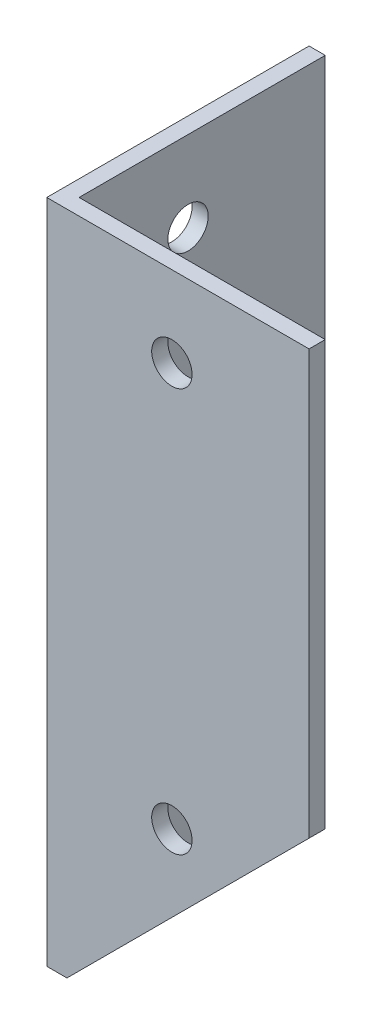
ISO-10303-21;
HEADER;
FILE_DESCRIPTION(('STEP AP214'),'2;1');
FILE_NAME('part.step','',(''),(''),'','','');
FILE_SCHEMA(('AUTOMOTIVE_DESIGN { 1 0 10303 214 1 1 1 1 }'));
ENDSEC;
DATA;
#1=APPLICATION_CONTEXT('core data for automotive mechanical design processes');
#2=APPLICATION_PROTOCOL_DEFINITION('international standard','automotive_design',2000,#1);
#3=PRODUCT_CONTEXT('',#1,'mechanical');
#4=PRODUCT('Part','Part','',(#3));
#5=PRODUCT_RELATED_PRODUCT_CATEGORY('part','',(#4));
#6=PRODUCT_DEFINITION_FORMATION('','',#4);
#7=PRODUCT_DEFINITION_CONTEXT('part definition',#1,'design');
#8=PRODUCT_DEFINITION('design','',#6,#7);
#9=PRODUCT_DEFINITION_SHAPE('','',#8);
#10=(LENGTH_UNIT() NAMED_UNIT(*) SI_UNIT(.MILLI.,.METRE.));
#11=(NAMED_UNIT(*) PLANE_ANGLE_UNIT() SI_UNIT($,.RADIAN.));
#12=(NAMED_UNIT(*) SI_UNIT($,.STERADIAN.) SOLID_ANGLE_UNIT());
#13=UNCERTAINTY_MEASURE_WITH_UNIT(LENGTH_MEASURE(1.E-05),#10,'distance_accuracy_value','');
#14=(GEOMETRIC_REPRESENTATION_CONTEXT(3) GLOBAL_UNCERTAINTY_ASSIGNED_CONTEXT((#13)) GLOBAL_UNIT_ASSIGNED_CONTEXT((#10,
#11,#12)) REPRESENTATION_CONTEXT('',''));
#15=CARTESIAN_POINT('',(0.,0.,0.));
#16=DIRECTION('',(0.,0.,1.));
#17=DIRECTION('',(1.,0.,0.));
#18=AXIS2_PLACEMENT_3D('',#15,#16,#17);
#19=CARTESIAN_POINT('',(4.,165.,0.));
#20=DIRECTION('',(-1.,0.,0.));
#21=DIRECTION('',(0.,0.,1.));
#22=AXIS2_PLACEMENT_3D('',#19,#20,#21);
#23=PLANE('',#22);
#24=CARTESIAN_POINT('',(4.,45.,-30.9999999999947));
#25=DIRECTION('',(-1.,0.,0.));
#26=DIRECTION('',(0.,0.,1.));
#27=AXIS2_PLACEMENT_3D('',#24,#25,#26);
#28=CIRCLE('',#27,4.99999999999998);
#29=CARTESIAN_POINT('',(4.,45.,-25.9999999999947));
#30=VERTEX_POINT('',#29);
#31=EDGE_CURVE('E197',#30,#30,#28,.T.);
#32=ORIENTED_EDGE('',*,*,#31,.T.);
#33=EDGE_LOOP('',(#32));
#34=FACE_BOUND('',#33,.T.);
#35=CARTESIAN_POINT('',(4.,10.,-15.));
#36=DIRECTION('',(-1.,0.,0.));
#37=DIRECTION('',(0.,0.,1.));
#38=AXIS2_PLACEMENT_3D('',#35,#36,#37);
#39=CIRCLE('',#38,5.);
#40=CARTESIAN_POINT('',(4.,10.,-10.));
#41=VERTEX_POINT('',#40);
#42=EDGE_CURVE('E194',#41,#41,#39,.T.);
#43=ORIENTED_EDGE('',*,*,#42,.T.);
#44=EDGE_LOOP('',(#43));
#45=FACE_BOUND('',#44,.T.);
#46=CARTESIAN_POINT('',(4.,9.99999999999937,-45.));
#47=DIRECTION('',(-1.,0.,0.));
#48=DIRECTION('',(0.,0.,1.));
#49=AXIS2_PLACEMENT_3D('',#46,#47,#48);
#50=CIRCLE('',#49,5.);
#51=CARTESIAN_POINT('',(4.,9.99999999999937,-40.));
#52=VERTEX_POINT('',#51);
#53=EDGE_CURVE('E189',#52,#52,#50,.T.);
#54=ORIENTED_EDGE('',*,*,#53,.T.);
#55=EDGE_LOOP('',(#54));
#56=FACE_BOUND('',#55,.T.);
#57=CARTESIAN_POINT('',(4.,145.,-31.));
#58=DIRECTION('',(-1.,0.,0.));
#59=DIRECTION('',(0.,0.,1.));
#60=AXIS2_PLACEMENT_3D('',#57,#58,#59);
#61=CIRCLE('',#60,5.);
#62=CARTESIAN_POINT('',(4.,145.,-26.));
#63=VERTEX_POINT('',#62);
#64=EDGE_CURVE('E153',#63,#63,#61,.T.);
#65=ORIENTED_EDGE('',*,*,#64,.T.);
#66=EDGE_LOOP('',(#65));
#67=FACE_BOUND('',#66,.T.);
#68=DIRECTION('',(0.,0.,-1.));
#69=VECTOR('',#68,1.);
#70=CARTESIAN_POINT('',(4.,0.,0.));
#71=LINE('',#70,#69);
#72=CARTESIAN_POINT('',(4.,0.,-4.));
#73=VERTEX_POINT('',#72);
#74=CARTESIAN_POINT('',(4.,0.,-65.));
#75=VERTEX_POINT('',#74);
#76=EDGE_CURVE('E124',#73,#75,#71,.T.);
#77=ORIENTED_EDGE('',*,*,#76,.T.);
#78=DIRECTION('',(0.,-1.,0.));
#79=VECTOR('',#78,1.);
#80=CARTESIAN_POINT('',(4.,165.,-65.));
#81=LINE('',#80,#79);
#82=CARTESIAN_POINT('',(4.,165.,-65.));
#83=VERTEX_POINT('',#82);
#84=EDGE_CURVE('E41',#83,#75,#81,.T.);
#85=ORIENTED_EDGE('',*,*,#84,.F.);
#86=DIRECTION('',(0.,0.,-1.));
#87=VECTOR('',#86,1.);
#88=CARTESIAN_POINT('',(4.,165.,0.));
#89=LINE('',#88,#87);
#90=CARTESIAN_POINT('',(4.,165.,-4.));
#91=VERTEX_POINT('',#90);
#92=EDGE_CURVE('E84',#91,#83,#89,.T.);
#93=ORIENTED_EDGE('',*,*,#92,.F.);
#94=DIRECTION('',(0.,-1.,0.));
#95=VECTOR('',#94,1.);
#96=CARTESIAN_POINT('',(4.,165.,-4.));
#97=LINE('',#96,#95);
#98=EDGE_CURVE('E120',#91,#73,#97,.T.);
#99=ORIENTED_EDGE('',*,*,#98,.T.);
#100=EDGE_LOOP('',(#77,#85,#93,#99));
#101=FACE_BOUND('',#100,.T.);
#102=ADVANCED_FACE('F34',(#34,#45,#56,#67,#101),#23,.F.);
#103=CARTESIAN_POINT('',(0.,165.,-65.));
#104=DIRECTION('',(0.,0.,-1.));
#105=DIRECTION('',(-1.,0.,0.));
#106=AXIS2_PLACEMENT_3D('',#103,#104,#105);
#107=PLANE('',#106);
#108=DIRECTION('',(1.,0.,0.));
#109=VECTOR('',#108,1.);
#110=CARTESIAN_POINT('',(0.,0.,-65.));
#111=LINE('',#110,#109);
#112=CARTESIAN_POINT('',(0.,0.,-65.));
#113=VERTEX_POINT('',#112);
#114=EDGE_CURVE('E127',#113,#75,#111,.T.);
#115=ORIENTED_EDGE('',*,*,#114,.F.);
#116=DIRECTION('',(0.,-1.,0.));
#117=VECTOR('',#116,1.);
#118=CARTESIAN_POINT('',(0.,165.,-65.));
#119=LINE('',#118,#117);
#120=CARTESIAN_POINT('',(0.,165.,-65.));
#121=VERTEX_POINT('',#120);
#122=EDGE_CURVE('E140',#121,#113,#119,.T.);
#123=ORIENTED_EDGE('',*,*,#122,.F.);
#124=DIRECTION('',(1.,0.,0.));
#125=VECTOR('',#124,1.);
#126=CARTESIAN_POINT('',(0.,165.,-65.));
#127=LINE('',#126,#125);
#128=EDGE_CURVE('E163',#121,#83,#127,.T.);
#129=ORIENTED_EDGE('',*,*,#128,.T.);
#130=ORIENTED_EDGE('',*,*,#84,.T.);
#131=EDGE_LOOP('',(#115,#123,#129,#130));
#132=FACE_BOUND('',#131,.T.);
#133=ADVANCED_FACE('F206',(#132),#107,.T.);
#134=CARTESIAN_POINT('',(0.,165.,0.));
#135=DIRECTION('',(-1.,0.,0.));
#136=DIRECTION('',(0.,0.,1.));
#137=AXIS2_PLACEMENT_3D('',#134,#135,#136);
#138=PLANE('',#137);
#139=CARTESIAN_POINT('',(0.,45.,-30.9999999999947));
#140=DIRECTION('',(-1.,0.,0.));
#141=DIRECTION('',(0.,0.,1.));
#142=AXIS2_PLACEMENT_3D('',#139,#140,#141);
#143=CIRCLE('',#142,4.99999999999998);
#144=CARTESIAN_POINT('',(0.,45.,-25.9999999999947));
#145=VERTEX_POINT('',#144);
#146=EDGE_CURVE('E186',#145,#145,#143,.T.);
#147=ORIENTED_EDGE('',*,*,#146,.F.);
#148=EDGE_LOOP('',(#147));
#149=FACE_BOUND('',#148,.T.);
#150=CARTESIAN_POINT('',(0.,10.,-15.));
#151=DIRECTION('',(-1.,0.,0.));
#152=DIRECTION('',(0.,0.,1.));
#153=AXIS2_PLACEMENT_3D('',#150,#151,#152);
#154=CIRCLE('',#153,5.);
#155=CARTESIAN_POINT('',(0.,10.,-10.));
#156=VERTEX_POINT('',#155);
#157=EDGE_CURVE('E181',#156,#156,#154,.T.);
#158=ORIENTED_EDGE('',*,*,#157,.F.);
#159=EDGE_LOOP('',(#158));
#160=FACE_BOUND('',#159,.T.);
#161=CARTESIAN_POINT('',(0.,9.99999999999937,-45.));
#162=DIRECTION('',(-1.,0.,0.));
#163=DIRECTION('',(0.,0.,1.));
#164=AXIS2_PLACEMENT_3D('',#161,#162,#163);
#165=CIRCLE('',#164,5.);
#166=CARTESIAN_POINT('',(0.,9.99999999999937,-40.));
#167=VERTEX_POINT('',#166);
#168=EDGE_CURVE('E177',#167,#167,#165,.T.);
#169=ORIENTED_EDGE('',*,*,#168,.F.);
#170=EDGE_LOOP('',(#169));
#171=FACE_BOUND('',#170,.T.);
#172=CARTESIAN_POINT('',(0.,145.,-31.));
#173=DIRECTION('',(-1.,0.,0.));
#174=DIRECTION('',(0.,0.,1.));
#175=AXIS2_PLACEMENT_3D('',#172,#173,#174);
#176=CIRCLE('',#175,5.);
#177=CARTESIAN_POINT('',(0.,145.,-26.));
#178=VERTEX_POINT('',#177);
#179=EDGE_CURVE('E158',#178,#178,#176,.T.);
#180=ORIENTED_EDGE('',*,*,#179,.F.);
#181=EDGE_LOOP('',(#180));
#182=FACE_BOUND('',#181,.T.);
#183=DIRECTION('',(0.,0.,-1.));
#184=VECTOR('',#183,1.);
#185=CARTESIAN_POINT('',(0.,0.,0.));
#186=LINE('',#185,#184);
#187=CARTESIAN_POINT('',(0.,0.,0.));
#188=VERTEX_POINT('',#187);
#189=EDGE_CURVE('E131',#188,#113,#186,.T.);
#190=ORIENTED_EDGE('',*,*,#189,.F.);
#191=DIRECTION('',(0.,-1.,0.));
#192=VECTOR('',#191,1.);
#193=CARTESIAN_POINT('',(0.,165.,0.));
#194=LINE('',#193,#192);
#195=CARTESIAN_POINT('',(0.,165.,0.));
#196=VERTEX_POINT('',#195);
#197=EDGE_CURVE('E108',#196,#188,#194,.T.);
#198=ORIENTED_EDGE('',*,*,#197,.F.);
#199=DIRECTION('',(0.,0.,-1.));
#200=VECTOR('',#199,1.);
#201=CARTESIAN_POINT('',(0.,165.,0.));
#202=LINE('',#201,#200);
#203=EDGE_CURVE('E115',#196,#121,#202,.T.);
#204=ORIENTED_EDGE('',*,*,#203,.T.);
#205=ORIENTED_EDGE('',*,*,#122,.T.);
#206=EDGE_LOOP('',(#190,#198,#204,#205));
#207=FACE_BOUND('',#206,.T.);
#208=ADVANCED_FACE('F167',(#149,#160,#171,#182,#207),#138,.T.);
#209=CARTESIAN_POINT('',(0.,165.,0.));
#210=DIRECTION('',(0.,0.,1.));
#211=DIRECTION('',(1.,0.,0.));
#212=AXIS2_PLACEMENT_3D('',#209,#210,#211);
#213=PLANE('',#212);
#214=DIRECTION('',(-0.707106781186547,-0.707106781186547,0.));
#215=VECTOR('',#214,1.);
#216=CARTESIAN_POINT('',(5.,0.,0.));
#217=LINE('',#216,#215);
#218=CARTESIAN_POINT('',(65.,60.,0.));
#219=VERTEX_POINT('',#218);
#220=CARTESIAN_POINT('',(5.,0.,0.));
#221=VERTEX_POINT('',#220);
#222=EDGE_CURVE('E47',#219,#221,#217,.T.);
#223=ORIENTED_EDGE('',*,*,#222,.F.);
#224=DIRECTION('',(0.,-1.,0.));
#225=VECTOR('',#224,1.);
#226=CARTESIAN_POINT('',(65.,165.,0.));
#227=LINE('',#226,#225);
#228=CARTESIAN_POINT('',(65.,165.,0.));
#229=VERTEX_POINT('',#228);
#230=EDGE_CURVE('E97',#229,#219,#227,.T.);
#231=ORIENTED_EDGE('',*,*,#230,.F.);
#232=DIRECTION('',(-1.,0.,0.));
#233=VECTOR('',#232,1.);
#234=CARTESIAN_POINT('',(0.,165.,0.));
#235=LINE('',#234,#233);
#236=EDGE_CURVE('E102',#229,#196,#235,.T.);
#237=ORIENTED_EDGE('',*,*,#236,.T.);
#238=ORIENTED_EDGE('',*,*,#197,.T.);
#239=DIRECTION('',(-1.,0.,0.));
#240=VECTOR('',#239,1.);
#241=CARTESIAN_POINT('',(0.,0.,0.));
#242=LINE('',#241,#240);
#243=EDGE_CURVE('E134',#221,#188,#242,.T.);
#244=ORIENTED_EDGE('',*,*,#243,.F.);
#245=EDGE_LOOP('',(#223,#231,#237,#238,#244));
#246=FACE_BOUND('',#245,.T.);
#247=CARTESIAN_POINT('',(31.0000000000053,45.,0.));
#248=DIRECTION('',(0.,0.,1.));
#249=DIRECTION('',(1.,0.,0.));
#250=AXIS2_PLACEMENT_3D('',#247,#248,#249);
#251=CIRCLE('',#250,5.00000000000001);
#252=CARTESIAN_POINT('',(36.0000000000053,45.,0.));
#253=VERTEX_POINT('',#252);
#254=EDGE_CURVE('E147',#253,#253,#251,.T.);
#255=ORIENTED_EDGE('',*,*,#254,.F.);
#256=EDGE_LOOP('',(#255));
#257=FACE_BOUND('',#256,.T.);
#258=CARTESIAN_POINT('',(31.,145.,0.));
#259=DIRECTION('',(0.,0.,1.));
#260=DIRECTION('',(1.,0.,0.));
#261=AXIS2_PLACEMENT_3D('',#258,#259,#260);
#262=CIRCLE('',#261,5.);
#263=CARTESIAN_POINT('',(36.,145.,0.));
#264=VERTEX_POINT('',#263);
#265=EDGE_CURVE('E144',#264,#264,#262,.T.);
#266=ORIENTED_EDGE('',*,*,#265,.F.);
#267=EDGE_LOOP('',(#266));
#268=FACE_BOUND('',#267,.T.);
#269=ADVANCED_FACE('F99',(#246,#257,#268),#213,.T.);
#270=CARTESIAN_POINT('',(65.,165.,-4.));
#271=DIRECTION('',(1.,0.,0.));
#272=DIRECTION('',(0.,0.,-1.));
#273=AXIS2_PLACEMENT_3D('',#270,#271,#272);
#274=PLANE('',#273);
#275=DIRECTION('',(0.,0.,1.));
#276=VECTOR('',#275,1.);
#277=CARTESIAN_POINT('',(65.,60.,-65.));
#278=LINE('',#277,#276);
#279=CARTESIAN_POINT('',(65.,60.,-4.));
#280=VERTEX_POINT('',#279);
#281=EDGE_CURVE('E178',#280,#219,#278,.T.);
#282=ORIENTED_EDGE('',*,*,#281,.F.);
#283=DIRECTION('',(0.,-1.,0.));
#284=VECTOR('',#283,1.);
#285=CARTESIAN_POINT('',(65.,165.,-4.));
#286=LINE('',#285,#284);
#287=CARTESIAN_POINT('',(65.,165.,-4.));
#288=VERTEX_POINT('',#287);
#289=EDGE_CURVE('E109',#288,#280,#286,.T.);
#290=ORIENTED_EDGE('',*,*,#289,.F.);
#291=DIRECTION('',(0.,0.,1.));
#292=VECTOR('',#291,1.);
#293=CARTESIAN_POINT('',(65.,165.,-4.));
#294=LINE('',#293,#292);
#295=EDGE_CURVE('E113',#288,#229,#294,.T.);
#296=ORIENTED_EDGE('',*,*,#295,.T.);
#297=ORIENTED_EDGE('',*,*,#230,.T.);
#298=EDGE_LOOP('',(#282,#290,#296,#297));
#299=FACE_BOUND('',#298,.T.);
#300=ADVANCED_FACE('F117',(#299),#274,.T.);
#301=CARTESIAN_POINT('',(0.,165.,-4.));
#302=DIRECTION('',(0.,0.,1.));
#303=DIRECTION('',(1.,0.,0.));
#304=AXIS2_PLACEMENT_3D('',#301,#302,#303);
#305=PLANE('',#304);
#306=CARTESIAN_POINT('',(31.0000000000053,45.,-4.));
#307=DIRECTION('',(0.,0.,1.));
#308=DIRECTION('',(1.,0.,0.));
#309=AXIS2_PLACEMENT_3D('',#306,#307,#308);
#310=CIRCLE('',#309,5.00000000000001);
#311=CARTESIAN_POINT('',(36.0000000000053,45.,-4.));
#312=VERTEX_POINT('',#311);
#313=EDGE_CURVE('E145',#312,#312,#310,.T.);
#314=ORIENTED_EDGE('',*,*,#313,.T.);
#315=EDGE_LOOP('',(#314));
#316=FACE_BOUND('',#315,.T.);
#317=CARTESIAN_POINT('',(31.,145.,-4.));
#318=DIRECTION('',(0.,0.,1.));
#319=DIRECTION('',(1.,0.,0.));
#320=AXIS2_PLACEMENT_3D('',#317,#318,#319);
#321=CIRCLE('',#320,5.);
#322=CARTESIAN_POINT('',(36.,145.,-4.));
#323=VERTEX_POINT('',#322);
#324=EDGE_CURVE('E128',#323,#323,#321,.T.);
#325=ORIENTED_EDGE('',*,*,#324,.T.);
#326=EDGE_LOOP('',(#325));
#327=FACE_BOUND('',#326,.T.);
#328=ORIENTED_EDGE('',*,*,#289,.T.);
#329=DIRECTION('',(-0.707106781186548,-0.707106781186548,0.));
#330=VECTOR('',#329,1.);
#331=CARTESIAN_POINT('',(85.,80.,-4.));
#332=LINE('',#331,#330);
#333=CARTESIAN_POINT('',(5.,0.,-4.));
#334=VERTEX_POINT('',#333);
#335=EDGE_CURVE('E175',#280,#334,#332,.T.);
#336=ORIENTED_EDGE('',*,*,#335,.T.);
#337=DIRECTION('',(1.,0.,0.));
#338=VECTOR('',#337,1.);
#339=CARTESIAN_POINT('',(0.,0.,-4.));
#340=LINE('',#339,#338);
#341=EDGE_CURVE('E78',#334,#73,#340,.F.);
#342=ORIENTED_EDGE('',*,*,#341,.T.);
#343=ORIENTED_EDGE('',*,*,#98,.F.);
#344=DIRECTION('',(1.,0.,0.));
#345=VECTOR('',#344,1.);
#346=CARTESIAN_POINT('',(0.,165.,-4.));
#347=LINE('',#346,#345);
#348=EDGE_CURVE('E56',#288,#91,#347,.F.);
#349=ORIENTED_EDGE('',*,*,#348,.F.);
#350=EDGE_LOOP('',(#328,#336,#342,#343,#349));
#351=FACE_BOUND('',#350,.T.);
#352=ADVANCED_FACE('F176',(#316,#327,#351),#305,.F.);
#353=CARTESIAN_POINT('',(0.,165.,0.));
#354=DIRECTION('',(0.,-1.,0.));
#355=DIRECTION('',(-1.,0.,0.));
#356=AXIS2_PLACEMENT_3D('',#353,#354,#355);
#357=PLANE('',#356);
#358=ORIENTED_EDGE('',*,*,#92,.T.);
#359=ORIENTED_EDGE('',*,*,#128,.F.);
#360=ORIENTED_EDGE('',*,*,#203,.F.);
#361=ORIENTED_EDGE('',*,*,#236,.F.);
#362=ORIENTED_EDGE('',*,*,#295,.F.);
#363=ORIENTED_EDGE('',*,*,#348,.T.);
#364=EDGE_LOOP('',(#358,#359,#360,#361,#362,#363));
#365=FACE_BOUND('',#364,.T.);
#366=ADVANCED_FACE('F112',(#365),#357,.F.);
#367=CARTESIAN_POINT('',(0.,0.,0.));
#368=DIRECTION('',(0.,-1.,0.));
#369=DIRECTION('',(-1.,0.,0.));
#370=AXIS2_PLACEMENT_3D('',#367,#368,#369);
#371=PLANE('',#370);
#372=DIRECTION('',(0.,0.,-1.));
#373=VECTOR('',#372,1.);
#374=CARTESIAN_POINT('',(5.,0.,0.));
#375=LINE('',#374,#373);
#376=EDGE_CURVE('E11',#221,#334,#375,.T.);
#377=ORIENTED_EDGE('',*,*,#376,.F.);
#378=ORIENTED_EDGE('',*,*,#243,.T.);
#379=ORIENTED_EDGE('',*,*,#189,.T.);
#380=ORIENTED_EDGE('',*,*,#114,.T.);
#381=ORIENTED_EDGE('',*,*,#76,.F.);
#382=ORIENTED_EDGE('',*,*,#341,.F.);
#383=EDGE_LOOP('',(#377,#378,#379,#380,#381,#382));
#384=FACE_BOUND('',#383,.T.);
#385=ADVANCED_FACE('F170',(#384),#371,.T.);
#386=CARTESIAN_POINT('',(31.,145.,-10.));
#387=DIRECTION('',(0.,0.,1.));
#388=DIRECTION('',(1.,0.,0.));
#389=AXIS2_PLACEMENT_3D('',#386,#387,#388);
#390=CYLINDRICAL_SURFACE('',#389,5.);
#391=ORIENTED_EDGE('',*,*,#265,.T.);
#392=EDGE_LOOP('',(#391));
#393=FACE_BOUND('',#392,.T.);
#394=ORIENTED_EDGE('',*,*,#324,.F.);
#395=EDGE_LOOP('',(#394));
#396=FACE_BOUND('',#395,.T.);
#397=ADVANCED_FACE('F240',(#393,#396),#390,.F.);
#398=CARTESIAN_POINT('',(31.0000000000053,45.,-10.));
#399=DIRECTION('',(0.,0.,1.));
#400=DIRECTION('',(1.,0.,0.));
#401=AXIS2_PLACEMENT_3D('',#398,#399,#400);
#402=CYLINDRICAL_SURFACE('',#401,5.00000000000001);
#403=ORIENTED_EDGE('',*,*,#254,.T.);
#404=EDGE_LOOP('',(#403));
#405=FACE_BOUND('',#404,.T.);
#406=ORIENTED_EDGE('',*,*,#313,.F.);
#407=EDGE_LOOP('',(#406));
#408=FACE_BOUND('',#407,.T.);
#409=ADVANCED_FACE('F231',(#405,#408),#402,.F.);
#410=CARTESIAN_POINT('',(10.,145.,-31.));
#411=DIRECTION('',(-1.,0.,0.));
#412=DIRECTION('',(0.,0.,1.));
#413=AXIS2_PLACEMENT_3D('',#410,#411,#412);
#414=CYLINDRICAL_SURFACE('',#413,5.);
#415=ORIENTED_EDGE('',*,*,#179,.T.);
#416=EDGE_LOOP('',(#415));
#417=FACE_BOUND('',#416,.T.);
#418=ORIENTED_EDGE('',*,*,#64,.F.);
#419=EDGE_LOOP('',(#418));
#420=FACE_BOUND('',#419,.T.);
#421=ADVANCED_FACE('F202',(#417,#420),#414,.F.);
#422=CARTESIAN_POINT('',(10.,9.99999999999937,-45.));
#423=DIRECTION('',(-1.,0.,0.));
#424=DIRECTION('',(0.,0.,1.));
#425=AXIS2_PLACEMENT_3D('',#422,#423,#424);
#426=CYLINDRICAL_SURFACE('',#425,5.);
#427=ORIENTED_EDGE('',*,*,#168,.T.);
#428=EDGE_LOOP('',(#427));
#429=FACE_BOUND('',#428,.T.);
#430=ORIENTED_EDGE('',*,*,#53,.F.);
#431=EDGE_LOOP('',(#430));
#432=FACE_BOUND('',#431,.T.);
#433=ADVANCED_FACE('F230',(#429,#432),#426,.F.);
#434=CARTESIAN_POINT('',(10.,10.,-15.));
#435=DIRECTION('',(-1.,0.,0.));
#436=DIRECTION('',(0.,0.,1.));
#437=AXIS2_PLACEMENT_3D('',#434,#435,#436);
#438=CYLINDRICAL_SURFACE('',#437,5.);
#439=ORIENTED_EDGE('',*,*,#157,.T.);
#440=EDGE_LOOP('',(#439));
#441=FACE_BOUND('',#440,.T.);
#442=ORIENTED_EDGE('',*,*,#42,.F.);
#443=EDGE_LOOP('',(#442));
#444=FACE_BOUND('',#443,.T.);
#445=ADVANCED_FACE('F237',(#441,#444),#438,.F.);
#446=CARTESIAN_POINT('',(10.,45.,-30.9999999999947));
#447=DIRECTION('',(-1.,0.,0.));
#448=DIRECTION('',(0.,0.,1.));
#449=AXIS2_PLACEMENT_3D('',#446,#447,#448);
#450=CYLINDRICAL_SURFACE('',#449,4.99999999999998);
#451=ORIENTED_EDGE('',*,*,#146,.T.);
#452=EDGE_LOOP('',(#451));
#453=FACE_BOUND('',#452,.T.);
#454=ORIENTED_EDGE('',*,*,#31,.F.);
#455=EDGE_LOOP('',(#454));
#456=FACE_BOUND('',#455,.T.);
#457=ADVANCED_FACE('F309',(#453,#456),#450,.F.);
#458=CARTESIAN_POINT('',(5.,0.,-65.));
#459=DIRECTION('',(-0.707106781186547,0.707106781186547,0.));
#460=DIRECTION('',(-0.707106781186548,-0.707106781186548,0.));
#461=AXIS2_PLACEMENT_3D('',#458,#459,#460);
#462=PLANE('',#461);
#463=ORIENTED_EDGE('',*,*,#281,.T.);
#464=ORIENTED_EDGE('',*,*,#222,.T.);
#465=ORIENTED_EDGE('',*,*,#376,.T.);
#466=ORIENTED_EDGE('',*,*,#335,.F.);
#467=EDGE_LOOP('',(#463,#464,#465,#466));
#468=FACE_BOUND('',#467,.T.);
#469=ADVANCED_FACE('F173',(#468),#462,.F.);
#470=CLOSED_SHELL('',(#102,#133,#208,#269,#300,#352,#366,#385,#397,#409,#421,#433,#445,#457,#469));
#471=MANIFOLD_SOLID_BREP('B2',#470);
#472=ADVANCED_BREP_SHAPE_REPRESENTATION('',(#18,#471),#14);
#473=SHAPE_DEFINITION_REPRESENTATION(#9,#472);
ENDSEC;
END-ISO-10303-21;
